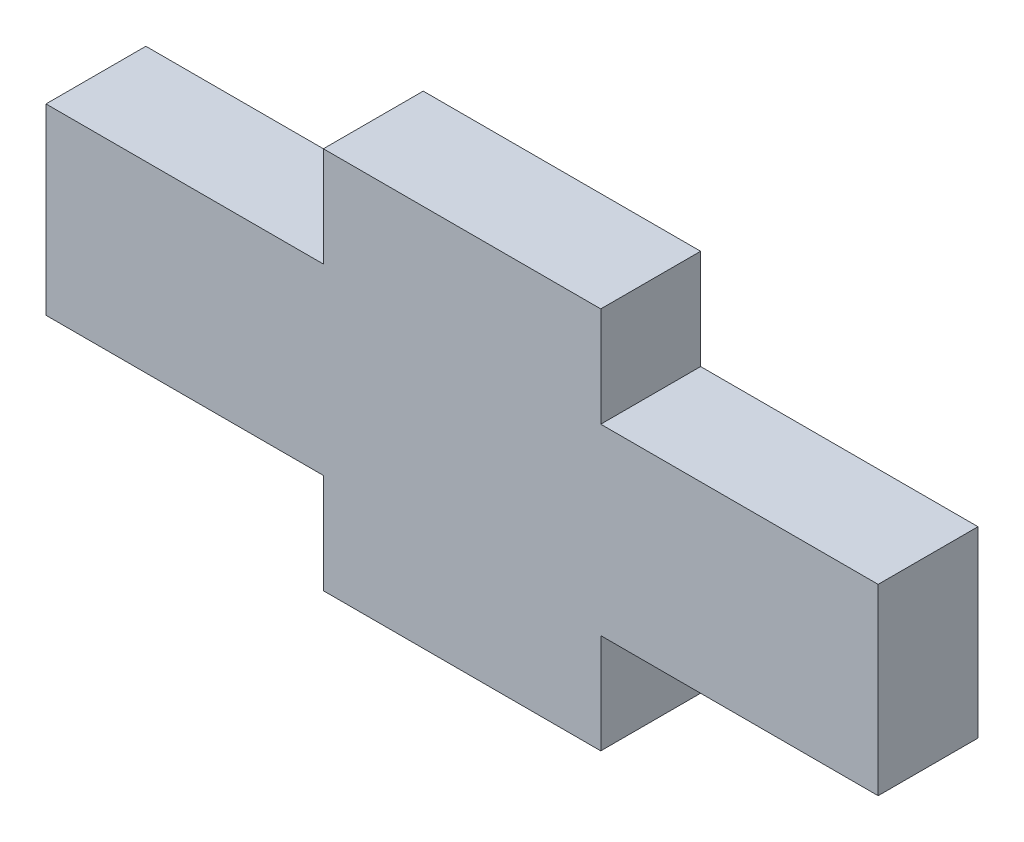
ISO-10303-21;
HEADER;
FILE_DESCRIPTION(('STEP AP214'),'2;1');
FILE_NAME('part.step','',(''),(''),'','','');
FILE_SCHEMA(('AUTOMOTIVE_DESIGN { 1 0 10303 214 1 1 1 1 }'));
ENDSEC;
DATA;
#1=APPLICATION_CONTEXT('core data for automotive mechanical design processes');
#2=APPLICATION_PROTOCOL_DEFINITION('international standard','automotive_design',2000,#1);
#3=PRODUCT_CONTEXT('',#1,'mechanical');
#4=PRODUCT('Part','Part','',(#3));
#5=PRODUCT_RELATED_PRODUCT_CATEGORY('part','',(#4));
#6=PRODUCT_DEFINITION_FORMATION('','',#4);
#7=PRODUCT_DEFINITION_CONTEXT('part definition',#1,'design');
#8=PRODUCT_DEFINITION('design','',#6,#7);
#9=PRODUCT_DEFINITION_SHAPE('','',#8);
#10=(LENGTH_UNIT() NAMED_UNIT(*) SI_UNIT(.MILLI.,.METRE.));
#11=(NAMED_UNIT(*) PLANE_ANGLE_UNIT() SI_UNIT($,.RADIAN.));
#12=(NAMED_UNIT(*) SI_UNIT($,.STERADIAN.) SOLID_ANGLE_UNIT());
#13=UNCERTAINTY_MEASURE_WITH_UNIT(LENGTH_MEASURE(1.E-05),#10,'distance_accuracy_value','');
#14=(GEOMETRIC_REPRESENTATION_CONTEXT(3) GLOBAL_UNCERTAINTY_ASSIGNED_CONTEXT((#13)) GLOBAL_UNIT_ASSIGNED_CONTEXT((#10,
#11,#12)) REPRESENTATION_CONTEXT('',''));
#15=CARTESIAN_POINT('',(0.,0.,0.));
#16=DIRECTION('',(0.,0.,1.));
#17=DIRECTION('',(1.,0.,0.));
#18=AXIS2_PLACEMENT_3D('',#15,#16,#17);
#19=CARTESIAN_POINT('',(0.,0.,6.096));
#20=DIRECTION('',(1.,0.,0.));
#21=DIRECTION('',(0.,0.,-1.));
#22=AXIS2_PLACEMENT_3D('',#19,#20,#21);
#23=PLANE('',#22);
#24=DIRECTION('',(0.,-1.,0.));
#25=VECTOR('',#24,1.);
#26=CARTESIAN_POINT('',(0.,0.,0.));
#27=LINE('',#26,#25);
#28=CARTESIAN_POINT('',(0.,11.176,0.));
#29=VERTEX_POINT('',#28);
#30=CARTESIAN_POINT('',(0.,0.,0.));
#31=VERTEX_POINT('',#30);
#32=EDGE_CURVE('E152',#29,#31,#27,.T.);
#33=ORIENTED_EDGE('',*,*,#32,.T.);
#34=DIRECTION('',(0.,0.,-1.));
#35=VECTOR('',#34,1.);
#36=CARTESIAN_POINT('',(0.,0.,6.096));
#37=LINE('',#36,#35);
#38=CARTESIAN_POINT('',(0.,0.,6.096));
#39=VERTEX_POINT('',#38);
#40=EDGE_CURVE('E11',#39,#31,#37,.T.);
#41=ORIENTED_EDGE('',*,*,#40,.F.);
#42=DIRECTION('',(0.,-1.,0.));
#43=VECTOR('',#42,1.);
#44=CARTESIAN_POINT('',(0.,0.,6.096));
#45=LINE('',#44,#43);
#46=CARTESIAN_POINT('',(0.,11.176,6.096));
#47=VERTEX_POINT('',#46);
#48=EDGE_CURVE('E174',#47,#39,#45,.T.);
#49=ORIENTED_EDGE('',*,*,#48,.F.);
#50=DIRECTION('',(0.,0.,-1.));
#51=VECTOR('',#50,1.);
#52=CARTESIAN_POINT('',(0.,11.176,6.096));
#53=LINE('',#52,#51);
#54=EDGE_CURVE('E148',#47,#29,#53,.T.);
#55=ORIENTED_EDGE('',*,*,#54,.T.);
#56=EDGE_LOOP('',(#33,#41,#49,#55));
#57=FACE_BOUND('',#56,.T.);
#58=ADVANCED_FACE('F32',(#57),#23,.F.);
#59=CARTESIAN_POINT('',(0.,0.,6.096));
#60=DIRECTION('',(0.,1.,0.));
#61=DIRECTION('',(0.,0.,1.));
#62=AXIS2_PLACEMENT_3D('',#59,#60,#61);
#63=PLANE('',#62);
#64=DIRECTION('',(1.,0.,0.));
#65=VECTOR('',#64,1.);
#66=CARTESIAN_POINT('',(0.,0.,0.));
#67=LINE('',#66,#65);
#68=CARTESIAN_POINT('',(16.9333333333333,0.,0.));
#69=VERTEX_POINT('',#68);
#70=EDGE_CURVE('E155',#31,#69,#67,.T.);
#71=ORIENTED_EDGE('',*,*,#70,.T.);
#72=DIRECTION('',(0.,0.,-1.));
#73=VECTOR('',#72,1.);
#74=CARTESIAN_POINT('',(16.9333333333333,0.,6.096));
#75=LINE('',#74,#73);
#76=CARTESIAN_POINT('',(16.9333333333333,0.,6.096));
#77=VERTEX_POINT('',#76);
#78=EDGE_CURVE('E40',#77,#69,#75,.T.);
#79=ORIENTED_EDGE('',*,*,#78,.F.);
#80=DIRECTION('',(1.,0.,0.));
#81=VECTOR('',#80,1.);
#82=CARTESIAN_POINT('',(0.,0.,6.096));
#83=LINE('',#82,#81);
#84=EDGE_CURVE('E103',#39,#77,#83,.T.);
#85=ORIENTED_EDGE('',*,*,#84,.F.);
#86=ORIENTED_EDGE('',*,*,#40,.T.);
#87=EDGE_LOOP('',(#71,#79,#85,#86));
#88=FACE_BOUND('',#87,.T.);
#89=ADVANCED_FACE('F252',(#88),#63,.F.);
#90=CARTESIAN_POINT('',(16.9333333333333,0.,6.096));
#91=DIRECTION('',(1.,0.,0.));
#92=DIRECTION('',(0.,0.,-1.));
#93=AXIS2_PLACEMENT_3D('',#90,#91,#92);
#94=PLANE('',#93);
#95=DIRECTION('',(0.,-1.,0.));
#96=VECTOR('',#95,1.);
#97=CARTESIAN_POINT('',(16.9333333333333,0.,0.));
#98=LINE('',#97,#96);
#99=CARTESIAN_POINT('',(16.9333333333333,-6.096,0.));
#100=VERTEX_POINT('',#99);
#101=EDGE_CURVE('E157',#69,#100,#98,.T.);
#102=ORIENTED_EDGE('',*,*,#101,.T.);
#103=DIRECTION('',(0.,0.,-1.));
#104=VECTOR('',#103,1.);
#105=CARTESIAN_POINT('',(16.9333333333333,-6.096,6.096));
#106=LINE('',#105,#104);
#107=CARTESIAN_POINT('',(16.9333333333333,-6.096,6.096));
#108=VERTEX_POINT('',#107);
#109=EDGE_CURVE('E193',#108,#100,#106,.T.);
#110=ORIENTED_EDGE('',*,*,#109,.F.);
#111=DIRECTION('',(0.,-1.,0.));
#112=VECTOR('',#111,1.);
#113=CARTESIAN_POINT('',(16.9333333333333,0.,6.096));
#114=LINE('',#113,#112);
#115=EDGE_CURVE('E201',#77,#108,#114,.T.);
#116=ORIENTED_EDGE('',*,*,#115,.F.);
#117=ORIENTED_EDGE('',*,*,#78,.T.);
#118=EDGE_LOOP('',(#102,#110,#116,#117));
#119=FACE_BOUND('',#118,.T.);
#120=ADVANCED_FACE('F199',(#119),#94,.F.);
#121=CARTESIAN_POINT('',(16.9333333333333,-6.096,6.096));
#122=DIRECTION('',(0.,1.,0.));
#123=DIRECTION('',(0.,0.,1.));
#124=AXIS2_PLACEMENT_3D('',#121,#122,#123);
#125=PLANE('',#124);
#126=DIRECTION('',(1.,0.,0.));
#127=VECTOR('',#126,1.);
#128=CARTESIAN_POINT('',(16.9333333333333,-6.096,0.));
#129=LINE('',#128,#127);
#130=CARTESIAN_POINT('',(33.8666666666667,-6.096,0.));
#131=VERTEX_POINT('',#130);
#132=EDGE_CURVE('E159',#100,#131,#129,.T.);
#133=ORIENTED_EDGE('',*,*,#132,.T.);
#134=DIRECTION('',(0.,0.,-1.));
#135=VECTOR('',#134,1.);
#136=CARTESIAN_POINT('',(33.8666666666667,-6.096,6.096));
#137=LINE('',#136,#135);
#138=CARTESIAN_POINT('',(33.8666666666667,-6.096,6.096));
#139=VERTEX_POINT('',#138);
#140=EDGE_CURVE('E190',#139,#131,#137,.T.);
#141=ORIENTED_EDGE('',*,*,#140,.F.);
#142=DIRECTION('',(1.,0.,0.));
#143=VECTOR('',#142,1.);
#144=CARTESIAN_POINT('',(16.9333333333333,-6.096,6.096));
#145=LINE('',#144,#143);
#146=EDGE_CURVE('E219',#108,#139,#145,.T.);
#147=ORIENTED_EDGE('',*,*,#146,.F.);
#148=ORIENTED_EDGE('',*,*,#109,.T.);
#149=EDGE_LOOP('',(#133,#141,#147,#148));
#150=FACE_BOUND('',#149,.T.);
#151=ADVANCED_FACE('F210',(#150),#125,.F.);
#152=CARTESIAN_POINT('',(33.8666666666667,0.,6.096));
#153=DIRECTION('',(-1.,0.,0.));
#154=DIRECTION('',(0.,0.,1.));
#155=AXIS2_PLACEMENT_3D('',#152,#153,#154);
#156=PLANE('',#155);
#157=DIRECTION('',(0.,1.,0.));
#158=VECTOR('',#157,1.);
#159=CARTESIAN_POINT('',(33.8666666666667,0.,0.));
#160=LINE('',#159,#158);
#161=CARTESIAN_POINT('',(33.8666666666667,0.,0.));
#162=VERTEX_POINT('',#161);
#163=EDGE_CURVE('E161',#131,#162,#160,.T.);
#164=ORIENTED_EDGE('',*,*,#163,.T.);
#165=DIRECTION('',(0.,0.,-1.));
#166=VECTOR('',#165,1.);
#167=CARTESIAN_POINT('',(33.8666666666667,0.,6.096));
#168=LINE('',#167,#166);
#169=CARTESIAN_POINT('',(33.8666666666667,0.,6.096));
#170=VERTEX_POINT('',#169);
#171=EDGE_CURVE('E187',#170,#162,#168,.T.);
#172=ORIENTED_EDGE('',*,*,#171,.F.);
#173=DIRECTION('',(0.,1.,0.));
#174=VECTOR('',#173,1.);
#175=CARTESIAN_POINT('',(33.8666666666667,0.,6.096));
#176=LINE('',#175,#174);
#177=EDGE_CURVE('E216',#139,#170,#176,.T.);
#178=ORIENTED_EDGE('',*,*,#177,.F.);
#179=ORIENTED_EDGE('',*,*,#140,.T.);
#180=EDGE_LOOP('',(#164,#172,#178,#179));
#181=FACE_BOUND('',#180,.T.);
#182=ADVANCED_FACE('F214',(#181),#156,.F.);
#183=CARTESIAN_POINT('',(33.8666666666667,0.,6.096));
#184=DIRECTION('',(0.,1.,0.));
#185=DIRECTION('',(0.,0.,1.));
#186=AXIS2_PLACEMENT_3D('',#183,#184,#185);
#187=PLANE('',#186);
#188=DIRECTION('',(1.,0.,0.));
#189=VECTOR('',#188,1.);
#190=CARTESIAN_POINT('',(33.8666666666667,0.,0.));
#191=LINE('',#190,#189);
#192=CARTESIAN_POINT('',(50.8,0.,0.));
#193=VERTEX_POINT('',#192);
#194=EDGE_CURVE('E163',#162,#193,#191,.T.);
#195=ORIENTED_EDGE('',*,*,#194,.T.);
#196=DIRECTION('',(0.,0.,-1.));
#197=VECTOR('',#196,1.);
#198=CARTESIAN_POINT('',(50.8,0.,6.096));
#199=LINE('',#198,#197);
#200=CARTESIAN_POINT('',(50.8,0.,6.096));
#201=VERTEX_POINT('',#200);
#202=EDGE_CURVE('E184',#201,#193,#199,.T.);
#203=ORIENTED_EDGE('',*,*,#202,.F.);
#204=DIRECTION('',(1.,0.,0.));
#205=VECTOR('',#204,1.);
#206=CARTESIAN_POINT('',(33.8666666666667,0.,6.096));
#207=LINE('',#206,#205);
#208=EDGE_CURVE('E218',#170,#201,#207,.T.);
#209=ORIENTED_EDGE('',*,*,#208,.F.);
#210=ORIENTED_EDGE('',*,*,#171,.T.);
#211=EDGE_LOOP('',(#195,#203,#209,#210));
#212=FACE_BOUND('',#211,.T.);
#213=ADVANCED_FACE('F265',(#212),#187,.F.);
#214=CARTESIAN_POINT('',(50.8,0.,6.096));
#215=DIRECTION('',(-1.,0.,0.));
#216=DIRECTION('',(0.,0.,1.));
#217=AXIS2_PLACEMENT_3D('',#214,#215,#216);
#218=PLANE('',#217);
#219=DIRECTION('',(0.,1.,0.));
#220=VECTOR('',#219,1.);
#221=CARTESIAN_POINT('',(50.8,0.,0.));
#222=LINE('',#221,#220);
#223=CARTESIAN_POINT('',(50.8,11.176,0.));
#224=VERTEX_POINT('',#223);
#225=EDGE_CURVE('E165',#193,#224,#222,.T.);
#226=ORIENTED_EDGE('',*,*,#225,.T.);
#227=DIRECTION('',(0.,0.,-1.));
#228=VECTOR('',#227,1.);
#229=CARTESIAN_POINT('',(50.8,11.176,6.096));
#230=LINE('',#229,#228);
#231=CARTESIAN_POINT('',(50.8,11.176,6.096));
#232=VERTEX_POINT('',#231);
#233=EDGE_CURVE('E181',#232,#224,#230,.T.);
#234=ORIENTED_EDGE('',*,*,#233,.F.);
#235=DIRECTION('',(0.,1.,0.));
#236=VECTOR('',#235,1.);
#237=CARTESIAN_POINT('',(50.8,0.,6.096));
#238=LINE('',#237,#236);
#239=EDGE_CURVE('E221',#201,#232,#238,.T.);
#240=ORIENTED_EDGE('',*,*,#239,.F.);
#241=ORIENTED_EDGE('',*,*,#202,.T.);
#242=EDGE_LOOP('',(#226,#234,#240,#241));
#243=FACE_BOUND('',#242,.T.);
#244=ADVANCED_FACE('F268',(#243),#218,.F.);
#245=CARTESIAN_POINT('',(33.8666666666667,11.176,6.096));
#246=DIRECTION('',(0.,-1.,0.));
#247=DIRECTION('',(0.,0.,-1.));
#248=AXIS2_PLACEMENT_3D('',#245,#246,#247);
#249=PLANE('',#248);
#250=DIRECTION('',(-1.,0.,0.));
#251=VECTOR('',#250,1.);
#252=CARTESIAN_POINT('',(33.8666666666667,11.176,0.));
#253=LINE('',#252,#251);
#254=CARTESIAN_POINT('',(33.8666666666667,11.176,0.));
#255=VERTEX_POINT('',#254);
#256=EDGE_CURVE('E167',#224,#255,#253,.T.);
#257=ORIENTED_EDGE('',*,*,#256,.T.);
#258=DIRECTION('',(0.,0.,-1.));
#259=VECTOR('',#258,1.);
#260=CARTESIAN_POINT('',(33.8666666666667,11.176,6.096));
#261=LINE('',#260,#259);
#262=CARTESIAN_POINT('',(33.8666666666667,11.176,6.096));
#263=VERTEX_POINT('',#262);
#264=EDGE_CURVE('E178',#263,#255,#261,.T.);
#265=ORIENTED_EDGE('',*,*,#264,.F.);
#266=DIRECTION('',(-1.,0.,0.));
#267=VECTOR('',#266,1.);
#268=CARTESIAN_POINT('',(33.8666666666667,11.176,6.096));
#269=LINE('',#268,#267);
#270=EDGE_CURVE('E227',#232,#263,#269,.T.);
#271=ORIENTED_EDGE('',*,*,#270,.F.);
#272=ORIENTED_EDGE('',*,*,#233,.T.);
#273=EDGE_LOOP('',(#257,#265,#271,#272));
#274=FACE_BOUND('',#273,.T.);
#275=ADVANCED_FACE('F233',(#274),#249,.F.);
#276=CARTESIAN_POINT('',(33.8666666666667,11.176,6.096));
#277=DIRECTION('',(-1.,0.,0.));
#278=DIRECTION('',(0.,0.,1.));
#279=AXIS2_PLACEMENT_3D('',#276,#277,#278);
#280=PLANE('',#279);
#281=DIRECTION('',(0.,1.,0.));
#282=VECTOR('',#281,1.);
#283=CARTESIAN_POINT('',(33.8666666666667,11.176,0.));
#284=LINE('',#283,#282);
#285=CARTESIAN_POINT('',(33.8666666666667,17.272,0.));
#286=VERTEX_POINT('',#285);
#287=EDGE_CURVE('E169',#255,#286,#284,.T.);
#288=ORIENTED_EDGE('',*,*,#287,.T.);
#289=DIRECTION('',(0.,0.,-1.));
#290=VECTOR('',#289,1.);
#291=CARTESIAN_POINT('',(33.8666666666667,17.272,6.096));
#292=LINE('',#291,#290);
#293=CARTESIAN_POINT('',(33.8666666666667,17.272,6.096));
#294=VERTEX_POINT('',#293);
#295=EDGE_CURVE('E143',#294,#286,#292,.T.);
#296=ORIENTED_EDGE('',*,*,#295,.F.);
#297=DIRECTION('',(0.,1.,0.));
#298=VECTOR('',#297,1.);
#299=CARTESIAN_POINT('',(33.8666666666667,11.176,6.096));
#300=LINE('',#299,#298);
#301=EDGE_CURVE('E134',#263,#294,#300,.T.);
#302=ORIENTED_EDGE('',*,*,#301,.F.);
#303=ORIENTED_EDGE('',*,*,#264,.T.);
#304=EDGE_LOOP('',(#288,#296,#302,#303));
#305=FACE_BOUND('',#304,.T.);
#306=ADVANCED_FACE('F237',(#305),#280,.F.);
#307=CARTESIAN_POINT('',(16.9333333333333,17.272,6.096));
#308=DIRECTION('',(0.,-1.,0.));
#309=DIRECTION('',(0.,0.,-1.));
#310=AXIS2_PLACEMENT_3D('',#307,#308,#309);
#311=PLANE('',#310);
#312=DIRECTION('',(-1.,0.,0.));
#313=VECTOR('',#312,1.);
#314=CARTESIAN_POINT('',(16.9333333333333,17.272,0.));
#315=LINE('',#314,#313);
#316=CARTESIAN_POINT('',(16.9333333333333,17.272,0.));
#317=VERTEX_POINT('',#316);
#318=EDGE_CURVE('E142',#286,#317,#315,.T.);
#319=ORIENTED_EDGE('',*,*,#318,.T.);
#320=DIRECTION('',(0.,0.,-1.));
#321=VECTOR('',#320,1.);
#322=CARTESIAN_POINT('',(16.9333333333333,17.272,6.096));
#323=LINE('',#322,#321);
#324=CARTESIAN_POINT('',(16.9333333333333,17.272,6.096));
#325=VERTEX_POINT('',#324);
#326=EDGE_CURVE('E139',#325,#317,#323,.T.);
#327=ORIENTED_EDGE('',*,*,#326,.F.);
#328=DIRECTION('',(-1.,0.,0.));
#329=VECTOR('',#328,1.);
#330=CARTESIAN_POINT('',(16.9333333333333,17.272,6.096));
#331=LINE('',#330,#329);
#332=EDGE_CURVE('E128',#294,#325,#331,.T.);
#333=ORIENTED_EDGE('',*,*,#332,.F.);
#334=ORIENTED_EDGE('',*,*,#295,.T.);
#335=EDGE_LOOP('',(#319,#327,#333,#334));
#336=FACE_BOUND('',#335,.T.);
#337=ADVANCED_FACE('F140',(#336),#311,.F.);
#338=CARTESIAN_POINT('',(16.9333333333333,11.176,6.096));
#339=DIRECTION('',(1.,0.,0.));
#340=DIRECTION('',(0.,0.,-1.));
#341=AXIS2_PLACEMENT_3D('',#338,#339,#340);
#342=PLANE('',#341);
#343=DIRECTION('',(0.,-1.,0.));
#344=VECTOR('',#343,1.);
#345=CARTESIAN_POINT('',(16.9333333333333,11.176,0.));
#346=LINE('',#345,#344);
#347=CARTESIAN_POINT('',(16.9333333333333,11.176,0.));
#348=VERTEX_POINT('',#347);
#349=EDGE_CURVE('E89',#317,#348,#346,.T.);
#350=ORIENTED_EDGE('',*,*,#349,.T.);
#351=DIRECTION('',(0.,0.,-1.));
#352=VECTOR('',#351,1.);
#353=CARTESIAN_POINT('',(16.9333333333333,11.176,6.096));
#354=LINE('',#353,#352);
#355=CARTESIAN_POINT('',(16.9333333333333,11.176,6.096));
#356=VERTEX_POINT('',#355);
#357=EDGE_CURVE('E144',#356,#348,#354,.T.);
#358=ORIENTED_EDGE('',*,*,#357,.F.);
#359=DIRECTION('',(0.,-1.,0.));
#360=VECTOR('',#359,1.);
#361=CARTESIAN_POINT('',(16.9333333333333,11.176,6.096));
#362=LINE('',#361,#360);
#363=EDGE_CURVE('E132',#325,#356,#362,.T.);
#364=ORIENTED_EDGE('',*,*,#363,.F.);
#365=ORIENTED_EDGE('',*,*,#326,.T.);
#366=EDGE_LOOP('',(#350,#358,#364,#365));
#367=FACE_BOUND('',#366,.T.);
#368=ADVANCED_FACE('F146',(#367),#342,.F.);
#369=CARTESIAN_POINT('',(0.,11.176,6.096));
#370=DIRECTION('',(0.,-1.,0.));
#371=DIRECTION('',(0.,0.,-1.));
#372=AXIS2_PLACEMENT_3D('',#369,#370,#371);
#373=PLANE('',#372);
#374=DIRECTION('',(-1.,0.,0.));
#375=VECTOR('',#374,1.);
#376=CARTESIAN_POINT('',(0.,11.176,0.));
#377=LINE('',#376,#375);
#378=EDGE_CURVE('E95',#348,#29,#377,.T.);
#379=ORIENTED_EDGE('',*,*,#378,.T.);
#380=ORIENTED_EDGE('',*,*,#54,.F.);
#381=DIRECTION('',(-1.,0.,0.));
#382=VECTOR('',#381,1.);
#383=CARTESIAN_POINT('',(0.,11.176,6.096));
#384=LINE('',#383,#382);
#385=EDGE_CURVE('E48',#356,#47,#384,.T.);
#386=ORIENTED_EDGE('',*,*,#385,.F.);
#387=ORIENTED_EDGE('',*,*,#357,.T.);
#388=EDGE_LOOP('',(#379,#380,#386,#387));
#389=FACE_BOUND('',#388,.T.);
#390=ADVANCED_FACE('F241',(#389),#373,.F.);
#391=CARTESIAN_POINT('',(0.,0.,6.096));
#392=DIRECTION('',(0.,0.,-1.));
#393=DIRECTION('',(-1.,0.,0.));
#394=AXIS2_PLACEMENT_3D('',#391,#392,#393);
#395=PLANE('',#394);
#396=ORIENTED_EDGE('',*,*,#48,.T.);
#397=ORIENTED_EDGE('',*,*,#84,.T.);
#398=ORIENTED_EDGE('',*,*,#115,.T.);
#399=ORIENTED_EDGE('',*,*,#146,.T.);
#400=ORIENTED_EDGE('',*,*,#177,.T.);
#401=ORIENTED_EDGE('',*,*,#208,.T.);
#402=ORIENTED_EDGE('',*,*,#239,.T.);
#403=ORIENTED_EDGE('',*,*,#270,.T.);
#404=ORIENTED_EDGE('',*,*,#301,.T.);
#405=ORIENTED_EDGE('',*,*,#332,.T.);
#406=ORIENTED_EDGE('',*,*,#363,.T.);
#407=ORIENTED_EDGE('',*,*,#385,.T.);
#408=EDGE_LOOP('',(#396,#397,#398,#399,#400,#401,#402,#403,#404,#405,#406,#407));
#409=FACE_BOUND('',#408,.T.);
#410=ADVANCED_FACE('F130',(#409),#395,.F.);
#411=CARTESIAN_POINT('',(0.,0.,0.));
#412=DIRECTION('',(0.,0.,-1.));
#413=DIRECTION('',(-1.,0.,0.));
#414=AXIS2_PLACEMENT_3D('',#411,#412,#413);
#415=PLANE('',#414);
#416=ORIENTED_EDGE('',*,*,#32,.F.);
#417=ORIENTED_EDGE('',*,*,#378,.F.);
#418=ORIENTED_EDGE('',*,*,#349,.F.);
#419=ORIENTED_EDGE('',*,*,#318,.F.);
#420=ORIENTED_EDGE('',*,*,#287,.F.);
#421=ORIENTED_EDGE('',*,*,#256,.F.);
#422=ORIENTED_EDGE('',*,*,#225,.F.);
#423=ORIENTED_EDGE('',*,*,#194,.F.);
#424=ORIENTED_EDGE('',*,*,#163,.F.);
#425=ORIENTED_EDGE('',*,*,#132,.F.);
#426=ORIENTED_EDGE('',*,*,#101,.F.);
#427=ORIENTED_EDGE('',*,*,#70,.F.);
#428=EDGE_LOOP('',(#416,#417,#418,#419,#420,#421,#422,#423,#424,#425,#426,#427));
#429=FACE_BOUND('',#428,.T.);
#430=ADVANCED_FACE('F205',(#429),#415,.T.);
#431=CLOSED_SHELL('',(#58,#89,#120,#151,#182,#213,#244,#275,#306,#337,#368,#390,#410,#430));
#432=MANIFOLD_SOLID_BREP('B2',#431);
#433=ADVANCED_BREP_SHAPE_REPRESENTATION('',(#18,#432),#14);
#434=SHAPE_DEFINITION_REPRESENTATION(#9,#433);
ENDSEC;
END-ISO-10303-21;
